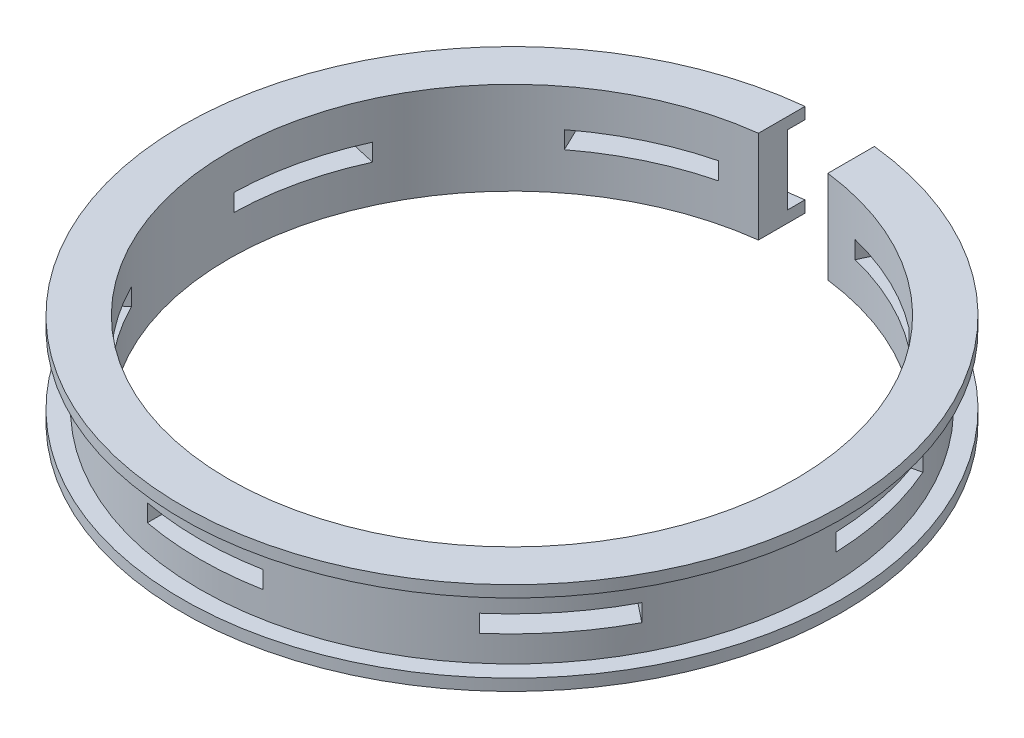
ISO-10303-21;
HEADER;
FILE_DESCRIPTION(('STEP AP214'),'2;1');
FILE_NAME('part.step','',(''),(''),'','','');
FILE_SCHEMA(('AUTOMOTIVE_DESIGN { 1 0 10303 214 1 1 1 1 }'));
ENDSEC;
DATA;
#1=APPLICATION_CONTEXT('core data for automotive mechanical design processes');
#2=APPLICATION_PROTOCOL_DEFINITION('international standard','automotive_design',2000,#1);
#3=PRODUCT_CONTEXT('',#1,'mechanical');
#4=PRODUCT('Part','Part','',(#3));
#5=PRODUCT_RELATED_PRODUCT_CATEGORY('part','',(#4));
#6=PRODUCT_DEFINITION_FORMATION('','',#4);
#7=PRODUCT_DEFINITION_CONTEXT('part definition',#1,'design');
#8=PRODUCT_DEFINITION('design','',#6,#7);
#9=PRODUCT_DEFINITION_SHAPE('','',#8);
#10=(LENGTH_UNIT() NAMED_UNIT(*) SI_UNIT(.MILLI.,.METRE.));
#11=(NAMED_UNIT(*) PLANE_ANGLE_UNIT() SI_UNIT($,.RADIAN.));
#12=(NAMED_UNIT(*) SI_UNIT($,.STERADIAN.) SOLID_ANGLE_UNIT());
#13=UNCERTAINTY_MEASURE_WITH_UNIT(LENGTH_MEASURE(1.E-05),#10,'distance_accuracy_value','');
#14=(GEOMETRIC_REPRESENTATION_CONTEXT(3) GLOBAL_UNCERTAINTY_ASSIGNED_CONTEXT((#13)) GLOBAL_UNIT_ASSIGNED_CONTEXT((#10,
#11,#12)) REPRESENTATION_CONTEXT('',''));
#15=CARTESIAN_POINT('',(0.,0.,0.));
#16=DIRECTION('',(0.,0.,1.));
#17=DIRECTION('',(1.,0.,0.));
#18=AXIS2_PLACEMENT_3D('',#15,#16,#17);
#19=CARTESIAN_POINT('',(0.,0.,0.));
#20=DIRECTION('',(0.,-1.,0.));
#21=DIRECTION('',(0.,0.,-1.));
#22=AXIS2_PLACEMENT_3D('',#19,#20,#21);
#23=CYLINDRICAL_SURFACE('',#22,24.5);
#24=CARTESIAN_POINT('',(0.,3.25,0.));
#25=DIRECTION('',(0.,1.,0.));
#26=DIRECTION('',(0.,0.,1.));
#27=AXIS2_PLACEMENT_3D('',#24,#25,#26);
#28=CIRCLE('',#27,24.5);
#29=CARTESIAN_POINT('',(-22.2704270119836,3.25,-10.2116639537302));
#30=VERTEX_POINT('',#29);
#31=CARTESIAN_POINT('',(-24.4956363515467,3.25,-0.462384831912012));
#32=VERTEX_POINT('',#31);
#33=EDGE_CURVE('E320',#30,#32,#28,.T.);
#34=ORIENTED_EDGE('',*,*,#33,.T.);
#35=DIRECTION('',(0.,-1.,0.));
#36=VECTOR('',#35,1.);
#37=CARTESIAN_POINT('',(-24.4956363515467,0.,-0.462384831912013));
#38=LINE('',#37,#36);
#39=CARTESIAN_POINT('',(-24.4956363515467,4.75000000000001,-0.462384831912012));
#40=VERTEX_POINT('',#39);
#41=EDGE_CURVE('E321',#32,#40,#38,.F.);
#42=ORIENTED_EDGE('',*,*,#41,.T.);
#43=CARTESIAN_POINT('',(0.,4.75000000000001,0.));
#44=DIRECTION('',(0.,-1.,0.));
#45=DIRECTION('',(0.,0.,-1.));
#46=AXIS2_PLACEMENT_3D('',#43,#44,#45);
#47=CIRCLE('',#46,24.5);
#48=CARTESIAN_POINT('',(-22.2704270119836,4.75000000000001,-10.2116639537302));
#49=VERTEX_POINT('',#48);
#50=EDGE_CURVE('E313',#40,#49,#47,.T.);
#51=ORIENTED_EDGE('',*,*,#50,.T.);
#52=DIRECTION('',(0.,-1.,0.));
#53=VECTOR('',#52,1.);
#54=CARTESIAN_POINT('',(-22.2704270119836,0.,-10.2116639537302));
#55=LINE('',#54,#53);
#56=EDGE_CURVE('E330',#49,#30,#55,.T.);
#57=ORIENTED_EDGE('',*,*,#56,.T.);
#58=EDGE_LOOP('',(#34,#42,#51,#57));
#59=FACE_BOUND('',#58,.T.);
#60=CARTESIAN_POINT('',(14.9112724366252,3.25,-19.4397519099587));
#61=VERTEX_POINT('',#60);
#62=CARTESIAN_POINT('',(5.90158375760104,3.25,-23.7785893011343));
#63=VERTEX_POINT('',#62);
#64=EDGE_CURVE('E317',#61,#63,#28,.T.);
#65=ORIENTED_EDGE('',*,*,#64,.T.);
#66=DIRECTION('',(0.,-1.,0.));
#67=VECTOR('',#66,1.);
#68=CARTESIAN_POINT('',(5.90158375760104,0.,-23.7785893011343));
#69=LINE('',#68,#67);
#70=CARTESIAN_POINT('',(5.90158375760104,4.75000000000001,-23.7785893011343));
#71=VERTEX_POINT('',#70);
#72=EDGE_CURVE('E341',#63,#71,#69,.F.);
#73=ORIENTED_EDGE('',*,*,#72,.T.);
#74=CARTESIAN_POINT('',(14.9112724366252,4.75000000000001,-19.4397519099587));
#75=VERTEX_POINT('',#74);
#76=EDGE_CURVE('E315',#71,#75,#47,.T.);
#77=ORIENTED_EDGE('',*,*,#76,.T.);
#78=DIRECTION('',(0.,-1.,0.));
#79=VECTOR('',#78,1.);
#80=CARTESIAN_POINT('',(14.9112724366252,0.,-19.4397519099587));
#81=LINE('',#80,#79);
#82=EDGE_CURVE('E344',#75,#61,#81,.T.);
#83=ORIENTED_EDGE('',*,*,#82,.T.);
#84=EDGE_LOOP('',(#65,#73,#77,#83));
#85=FACE_BOUND('',#84,.T.);
#86=CARTESIAN_POINT('',(21.8691844924211,4.75000000000001,11.0448526308163));
#87=VERTEX_POINT('',#86);
#88=CARTESIAN_POINT('',(15.6342864738337,4.75000000000001,18.8631674554965));
#89=VERTEX_POINT('',#88);
#90=EDGE_CURVE('E477',#87,#89,#47,.T.);
#91=ORIENTED_EDGE('',*,*,#90,.T.);
#92=DIRECTION('',(0.,-1.,0.));
#93=VECTOR('',#92,1.);
#94=CARTESIAN_POINT('',(15.6342864738337,0.,18.8631674554965));
#95=LINE('',#94,#93);
#96=CARTESIAN_POINT('',(15.6342864738337,3.25,18.8631674554965));
#97=VERTEX_POINT('',#96);
#98=EDGE_CURVE('E307',#89,#97,#95,.T.);
#99=ORIENTED_EDGE('',*,*,#98,.T.);
#100=CARTESIAN_POINT('',(21.8691844924211,3.25,11.0448526308163));
#101=VERTEX_POINT('',#100);
#102=EDGE_CURVE('E298',#97,#101,#28,.T.);
#103=ORIENTED_EDGE('',*,*,#102,.T.);
#104=DIRECTION('',(0.,-1.,0.));
#105=VECTOR('',#104,1.);
#106=CARTESIAN_POINT('',(21.8691844924211,0.,11.0448526308163));
#107=LINE('',#106,#105);
#108=EDGE_CURVE('E281',#101,#87,#107,.F.);
#109=ORIENTED_EDGE('',*,*,#108,.T.);
#110=EDGE_LOOP('',(#91,#99,#103,#109));
#111=FACE_BOUND('',#110,.T.);
#112=CARTESIAN_POINT('',(0.,0.,0.));
#113=DIRECTION('',(0.,-1.,0.));
#114=DIRECTION('',(0.,0.,-1.));
#115=AXIS2_PLACEMENT_3D('',#112,#113,#114);
#116=CIRCLE('',#115,24.5);
#117=CARTESIAN_POINT('',(3.,0.,-24.3156328315757));
#118=VERTEX_POINT('',#117);
#119=CARTESIAN_POINT('',(-3.,0.,-24.3156328315757));
#120=VERTEX_POINT('',#119);
#121=EDGE_CURVE('E568',#118,#120,#116,.T.);
#122=ORIENTED_EDGE('',*,*,#121,.T.);
#123=DIRECTION('',(0.,-1.,0.));
#124=VECTOR('',#123,1.);
#125=CARTESIAN_POINT('',(-3.,0.,-24.3156328315757));
#126=LINE('',#125,#124);
#127=CARTESIAN_POINT('',(-3.,8.,-24.3156328315757));
#128=VERTEX_POINT('',#127);
#129=EDGE_CURVE('E544',#120,#128,#126,.F.);
#130=ORIENTED_EDGE('',*,*,#129,.T.);
#131=CARTESIAN_POINT('',(0.,8.,0.));
#132=DIRECTION('',(0.,-1.,0.));
#133=DIRECTION('',(0.,0.,-1.));
#134=AXIS2_PLACEMENT_3D('',#131,#132,#133);
#135=CIRCLE('',#134,24.5);
#136=CARTESIAN_POINT('',(3.,8.,-24.3156328315757));
#137=VERTEX_POINT('',#136);
#138=EDGE_CURVE('E565',#137,#128,#135,.T.);
#139=ORIENTED_EDGE('',*,*,#138,.F.);
#140=DIRECTION('',(0.,-1.,0.));
#141=VECTOR('',#140,1.);
#142=CARTESIAN_POINT('',(3.,0.,-24.3156328315757));
#143=LINE('',#142,#141);
#144=EDGE_CURVE('E529',#137,#118,#143,.T.);
#145=ORIENTED_EDGE('',*,*,#144,.T.);
#146=EDGE_LOOP('',(#122,#130,#139,#145));
#147=FACE_BOUND('',#146,.T.);
#148=CARTESIAN_POINT('',(0.,3.25,0.));
#149=DIRECTION('',(0.,1.,0.));
#150=DIRECTION('',(0.,0.,1.));
#151=AXIS2_PLACEMENT_3D('',#148,#149,#150);
#152=CIRCLE('',#151,24.5);
#153=CARTESIAN_POINT('',(-5.,3.25,23.9843699104229));
#154=VERTEX_POINT('',#153);
#155=CARTESIAN_POINT('',(5.,3.25,23.9843699104229));
#156=VERTEX_POINT('',#155);
#157=EDGE_CURVE('E495',#154,#156,#152,.T.);
#158=ORIENTED_EDGE('',*,*,#157,.T.);
#159=DIRECTION('',(0.,-1.,0.));
#160=VECTOR('',#159,1.);
#161=CARTESIAN_POINT('',(5.,0.,23.9843699104229));
#162=LINE('',#161,#160);
#163=CARTESIAN_POINT('',(5.,4.75000000000001,23.9843699104229));
#164=VERTEX_POINT('',#163);
#165=EDGE_CURVE('E504',#156,#164,#162,.F.);
#166=ORIENTED_EDGE('',*,*,#165,.T.);
#167=CARTESIAN_POINT('',(0.,4.75000000000001,0.));
#168=DIRECTION('',(0.,-1.,0.));
#169=DIRECTION('',(0.,0.,-1.));
#170=AXIS2_PLACEMENT_3D('',#167,#168,#169);
#171=CIRCLE('',#170,24.5);
#172=CARTESIAN_POINT('',(-5.,4.75000000000001,23.9843699104229));
#173=VERTEX_POINT('',#172);
#174=EDGE_CURVE('E501',#164,#173,#171,.T.);
#175=ORIENTED_EDGE('',*,*,#174,.T.);
#176=DIRECTION('',(0.,-1.,0.));
#177=VECTOR('',#176,1.);
#178=CARTESIAN_POINT('',(-5.,0.,23.9843699104229));
#179=LINE('',#178,#177);
#180=EDGE_CURVE('E498',#173,#154,#179,.T.);
#181=ORIENTED_EDGE('',*,*,#180,.T.);
#182=EDGE_LOOP('',(#158,#166,#175,#181));
#183=FACE_BOUND('',#182,.T.);
#184=CARTESIAN_POINT('',(24.4956363515467,3.25,-0.462384831911679));
#185=VERTEX_POINT('',#184);
#186=CARTESIAN_POINT('',(22.2704270119837,3.25,-10.2116639537299));
#187=VERTEX_POINT('',#186);
#188=EDGE_CURVE('E309',#185,#187,#28,.T.);
#189=ORIENTED_EDGE('',*,*,#188,.T.);
#190=DIRECTION('',(0.,-1.,0.));
#191=VECTOR('',#190,1.);
#192=CARTESIAN_POINT('',(22.2704270119837,0.,-10.2116639537299));
#193=LINE('',#192,#191);
#194=CARTESIAN_POINT('',(22.2704270119837,4.75000000000001,-10.2116639537299));
#195=VERTEX_POINT('',#194);
#196=EDGE_CURVE('E347',#187,#195,#193,.F.);
#197=ORIENTED_EDGE('',*,*,#196,.T.);
#198=CARTESIAN_POINT('',(24.4956363515467,4.75000000000001,-0.462384831911678));
#199=VERTEX_POINT('',#198);
#200=EDGE_CURVE('E478',#195,#199,#47,.T.);
#201=ORIENTED_EDGE('',*,*,#200,.T.);
#202=DIRECTION('',(0.,-1.,0.));
#203=VECTOR('',#202,1.);
#204=CARTESIAN_POINT('',(24.4956363515467,0.,-0.462384831911679));
#205=LINE('',#204,#203);
#206=EDGE_CURVE('E292',#199,#185,#205,.T.);
#207=ORIENTED_EDGE('',*,*,#206,.T.);
#208=EDGE_LOOP('',(#189,#197,#201,#207));
#209=FACE_BOUND('',#208,.T.);
#210=CARTESIAN_POINT('',(-5.90158375760071,3.25,-23.7785893011344));
#211=VERTEX_POINT('',#210);
#212=CARTESIAN_POINT('',(-14.9112724366249,3.25,-19.4397519099589));
#213=VERTEX_POINT('',#212);
#214=EDGE_CURVE('E326',#211,#213,#28,.T.);
#215=ORIENTED_EDGE('',*,*,#214,.T.);
#216=DIRECTION('',(0.,-1.,0.));
#217=VECTOR('',#216,1.);
#218=CARTESIAN_POINT('',(-14.9112724366249,0.,-19.4397519099589));
#219=LINE('',#218,#217);
#220=CARTESIAN_POINT('',(-14.9112724366249,4.75000000000001,-19.4397519099589));
#221=VERTEX_POINT('',#220);
#222=EDGE_CURVE('E335',#213,#221,#219,.F.);
#223=ORIENTED_EDGE('',*,*,#222,.T.);
#224=CARTESIAN_POINT('',(-5.90158375760071,4.75000000000001,-23.7785893011344));
#225=VERTEX_POINT('',#224);
#226=EDGE_CURVE('E308',#221,#225,#47,.T.);
#227=ORIENTED_EDGE('',*,*,#226,.T.);
#228=DIRECTION('',(0.,-1.,0.));
#229=VECTOR('',#228,1.);
#230=CARTESIAN_POINT('',(-5.90158375760071,0.,-23.7785893011344));
#231=LINE('',#230,#229);
#232=EDGE_CURVE('E338',#225,#211,#231,.T.);
#233=ORIENTED_EDGE('',*,*,#232,.T.);
#234=EDGE_LOOP('',(#215,#223,#227,#233));
#235=FACE_BOUND('',#234,.T.);
#236=DIRECTION('',(0.,-1.,0.));
#237=VECTOR('',#236,1.);
#238=CARTESIAN_POINT('',(-15.6342864738339,0.,18.8631674554963));
#239=LINE('',#238,#237);
#240=CARTESIAN_POINT('',(-15.6342864738339,3.25,18.8631674554963));
#241=VERTEX_POINT('',#240);
#242=CARTESIAN_POINT('',(-15.6342864738339,4.75000000000001,18.8631674554963));
#243=VERTEX_POINT('',#242);
#244=EDGE_CURVE('E482',#241,#243,#239,.F.);
#245=ORIENTED_EDGE('',*,*,#244,.T.);
#246=CARTESIAN_POINT('',(-21.8691844924212,4.75000000000001,11.044852630816));
#247=VERTEX_POINT('',#246);
#248=EDGE_CURVE('E476',#243,#247,#47,.T.);
#249=ORIENTED_EDGE('',*,*,#248,.T.);
#250=DIRECTION('',(0.,-1.,0.));
#251=VECTOR('',#250,1.);
#252=CARTESIAN_POINT('',(-21.8691844924212,0.,11.044852630816));
#253=LINE('',#252,#251);
#254=CARTESIAN_POINT('',(-21.8691844924212,3.25,11.044852630816));
#255=VERTEX_POINT('',#254);
#256=EDGE_CURVE('E480',#247,#255,#253,.T.);
#257=ORIENTED_EDGE('',*,*,#256,.T.);
#258=EDGE_CURVE('E311',#255,#241,#28,.T.);
#259=ORIENTED_EDGE('',*,*,#258,.T.);
#260=EDGE_LOOP('',(#245,#249,#257,#259));
#261=FACE_BOUND('',#260,.T.);
#262=ADVANCED_FACE('F46',(#59,#85,#111,#147,#183,#209,#235,#261),#23,.F.);
#263=CARTESIAN_POINT('',(0.,0.,0.));
#264=DIRECTION('',(0.,-1.,0.));
#265=DIRECTION('',(0.,0.,-1.));
#266=AXIS2_PLACEMENT_3D('',#263,#264,#265);
#267=CYLINDRICAL_SURFACE('',#266,27.);
#268=CARTESIAN_POINT('',(0.,4.75000000000001,0.));
#269=DIRECTION('',(0.,-1.,0.));
#270=DIRECTION('',(0.,0.,-1.));
#271=AXIS2_PLACEMENT_3D('',#268,#269,#270);
#272=CIRCLE('',#271,27.);
#273=CARTESIAN_POINT('',(-24.7551559890317,4.75000000000001,-10.7787871283696));
#274=VERTEX_POINT('',#273);
#275=CARTESIAN_POINT('',(-26.9803653285949,4.75000000000001,-1.02950800655138));
#276=VERTEX_POINT('',#275);
#277=EDGE_CURVE('E56',#274,#276,#272,.F.);
#278=ORIENTED_EDGE('',*,*,#277,.T.);
#279=DIRECTION('',(0.,-1.,0.));
#280=VECTOR('',#279,1.);
#281=CARTESIAN_POINT('',(-26.9803653285949,0.,-1.02950800655138));
#282=LINE('',#281,#280);
#283=CARTESIAN_POINT('',(-26.9803653285949,3.25,-1.02950800655138));
#284=VERTEX_POINT('',#283);
#285=EDGE_CURVE('E426',#276,#284,#282,.T.);
#286=ORIENTED_EDGE('',*,*,#285,.T.);
#287=CARTESIAN_POINT('',(0.,3.25,0.));
#288=DIRECTION('',(0.,1.,0.));
#289=DIRECTION('',(0.,0.,1.));
#290=AXIS2_PLACEMENT_3D('',#287,#288,#289);
#291=CIRCLE('',#290,27.);
#292=CARTESIAN_POINT('',(-24.7551559890317,3.25,-10.7787871283696));
#293=VERTEX_POINT('',#292);
#294=EDGE_CURVE('E427',#284,#293,#291,.F.);
#295=ORIENTED_EDGE('',*,*,#294,.T.);
#296=DIRECTION('',(0.,-1.,0.));
#297=VECTOR('',#296,1.);
#298=CARTESIAN_POINT('',(-24.7551559890317,0.,-10.7787871283696));
#299=LINE('',#298,#297);
#300=EDGE_CURVE('E457',#293,#274,#299,.F.);
#301=ORIENTED_EDGE('',*,*,#300,.T.);
#302=EDGE_LOOP('',(#278,#286,#295,#301));
#303=FACE_BOUND('',#302,.T.);
#304=CARTESIAN_POINT('',(16.0170808618274,4.75000000000001,-21.7359867654009));
#305=VERTEX_POINT('',#304);
#306=CARTESIAN_POINT('',(7.00739218280321,4.75000000000001,-26.0748241565766));
#307=VERTEX_POINT('',#306);
#308=EDGE_CURVE('E436',#305,#307,#272,.F.);
#309=ORIENTED_EDGE('',*,*,#308,.T.);
#310=DIRECTION('',(0.,-1.,0.));
#311=VECTOR('',#310,1.);
#312=CARTESIAN_POINT('',(7.00739218280321,0.,-26.0748241565766));
#313=LINE('',#312,#311);
#314=CARTESIAN_POINT('',(7.00739218280321,3.25,-26.0748241565766));
#315=VERTEX_POINT('',#314);
#316=EDGE_CURVE('E445',#307,#315,#313,.T.);
#317=ORIENTED_EDGE('',*,*,#316,.T.);
#318=CARTESIAN_POINT('',(16.0170808618274,3.25,-21.7359867654009));
#319=VERTEX_POINT('',#318);
#320=EDGE_CURVE('E430',#315,#319,#291,.F.);
#321=ORIENTED_EDGE('',*,*,#320,.T.);
#322=DIRECTION('',(0.,-1.,0.));
#323=VECTOR('',#322,1.);
#324=CARTESIAN_POINT('',(16.0170808618274,0.,-21.7359867654009));
#325=LINE('',#324,#323);
#326=EDGE_CURVE('E439',#319,#305,#325,.F.);
#327=ORIENTED_EDGE('',*,*,#326,.T.);
#328=EDGE_LOOP('',(#309,#317,#321,#327));
#329=FACE_BOUND('',#328,.T.);
#330=CARTESIAN_POINT('',(23.8617824223638,3.25,12.6338964546878));
#331=VERTEX_POINT('',#330);
#332=CARTESIAN_POINT('',(17.6268844037763,3.25,20.452211279368));
#333=VERTEX_POINT('',#332);
#334=EDGE_CURVE('E301',#331,#333,#291,.F.);
#335=ORIENTED_EDGE('',*,*,#334,.T.);
#336=DIRECTION('',(0.,-1.,0.));
#337=VECTOR('',#336,1.);
#338=CARTESIAN_POINT('',(17.6268844037763,0.,20.452211279368));
#339=LINE('',#338,#337);
#340=CARTESIAN_POINT('',(17.6268844037763,4.75000000000001,20.452211279368));
#341=VERTEX_POINT('',#340);
#342=EDGE_CURVE('E412',#333,#341,#339,.F.);
#343=ORIENTED_EDGE('',*,*,#342,.T.);
#344=CARTESIAN_POINT('',(23.8617824223638,4.75000000000001,12.6338964546878));
#345=VERTEX_POINT('',#344);
#346=EDGE_CURVE('E57',#341,#345,#272,.F.);
#347=ORIENTED_EDGE('',*,*,#346,.T.);
#348=DIRECTION('',(0.,-1.,0.));
#349=VECTOR('',#348,1.);
#350=CARTESIAN_POINT('',(23.8617824223638,0.,12.6338964546878));
#351=LINE('',#350,#349);
#352=EDGE_CURVE('E417',#345,#331,#351,.T.);
#353=ORIENTED_EDGE('',*,*,#352,.T.);
#354=EDGE_LOOP('',(#335,#343,#347,#353));
#355=FACE_BOUND('',#354,.T.);
#356=CARTESIAN_POINT('',(0.,7.,0.));
#357=DIRECTION('',(0.,-1.,0.));
#358=DIRECTION('',(0.,0.,-1.));
#359=AXIS2_PLACEMENT_3D('',#356,#357,#358);
#360=CIRCLE('',#359,27.);
#361=CARTESIAN_POINT('',(3.,7.,-26.8328157299975));
#362=VERTEX_POINT('',#361);
#363=CARTESIAN_POINT('',(-3.,7.,-26.8328157299975));
#364=VERTEX_POINT('',#363);
#365=EDGE_CURVE('E556',#362,#364,#360,.T.);
#366=ORIENTED_EDGE('',*,*,#365,.T.);
#367=DIRECTION('',(0.,-1.,0.));
#368=VECTOR('',#367,1.);
#369=CARTESIAN_POINT('',(-3.,0.,-26.8328157299975));
#370=LINE('',#369,#368);
#371=CARTESIAN_POINT('',(-3.,1.,-26.8328157299975));
#372=VERTEX_POINT('',#371);
#373=EDGE_CURVE('E535',#364,#372,#370,.T.);
#374=ORIENTED_EDGE('',*,*,#373,.T.);
#375=CARTESIAN_POINT('',(0.,1.,0.));
#376=DIRECTION('',(0.,-1.,0.));
#377=DIRECTION('',(0.,0.,-1.));
#378=AXIS2_PLACEMENT_3D('',#375,#376,#377);
#379=CIRCLE('',#378,27.);
#380=CARTESIAN_POINT('',(3.,1.,-26.8328157299975));
#381=VERTEX_POINT('',#380);
#382=EDGE_CURVE('E553',#381,#372,#379,.T.);
#383=ORIENTED_EDGE('',*,*,#382,.F.);
#384=DIRECTION('',(0.,-1.,0.));
#385=VECTOR('',#384,1.);
#386=CARTESIAN_POINT('',(3.,0.,-26.8328157299975));
#387=LINE('',#386,#385);
#388=EDGE_CURVE('E520',#381,#362,#387,.F.);
#389=ORIENTED_EDGE('',*,*,#388,.T.);
#390=EDGE_LOOP('',(#366,#374,#383,#389));
#391=FACE_BOUND('',#390,.T.);
#392=CARTESIAN_POINT('',(0.,4.75000000000001,0.));
#393=DIRECTION('',(0.,-1.,0.));
#394=DIRECTION('',(0.,0.,-1.));
#395=AXIS2_PLACEMENT_3D('',#392,#393,#394);
#396=CIRCLE('',#395,27.);
#397=CARTESIAN_POINT('',(-5.,4.75000000000001,26.5329983228432));
#398=VERTEX_POINT('',#397);
#399=CARTESIAN_POINT('',(5.,4.75000000000001,26.5329983228432));
#400=VERTEX_POINT('',#399);
#401=EDGE_CURVE('E583',#398,#400,#396,.F.);
#402=ORIENTED_EDGE('',*,*,#401,.T.);
#403=DIRECTION('',(0.,-1.,0.));
#404=VECTOR('',#403,1.);
#405=CARTESIAN_POINT('',(5.,0.,26.5329983228432));
#406=LINE('',#405,#404);
#407=CARTESIAN_POINT('',(5.,3.25,26.5329983228432));
#408=VERTEX_POINT('',#407);
#409=EDGE_CURVE('E422',#400,#408,#406,.T.);
#410=ORIENTED_EDGE('',*,*,#409,.T.);
#411=CARTESIAN_POINT('',(0.,3.25,0.));
#412=DIRECTION('',(0.,1.,0.));
#413=DIRECTION('',(0.,0.,1.));
#414=AXIS2_PLACEMENT_3D('',#411,#412,#413);
#415=CIRCLE('',#414,27.);
#416=CARTESIAN_POINT('',(-5.,3.25,26.5329983228432));
#417=VERTEX_POINT('',#416);
#418=EDGE_CURVE('E577',#408,#417,#415,.F.);
#419=ORIENTED_EDGE('',*,*,#418,.T.);
#420=DIRECTION('',(0.,-1.,0.));
#421=VECTOR('',#420,1.);
#422=CARTESIAN_POINT('',(-5.,0.,26.5329983228432));
#423=LINE('',#422,#421);
#424=EDGE_CURVE('E580',#417,#398,#423,.F.);
#425=ORIENTED_EDGE('',*,*,#424,.T.);
#426=EDGE_LOOP('',(#402,#410,#419,#425));
#427=FACE_BOUND('',#426,.T.);
#428=CARTESIAN_POINT('',(26.9803653285949,4.75000000000001,-1.02950800655102));
#429=VERTEX_POINT('',#428);
#430=CARTESIAN_POINT('',(24.7551559890319,4.75000000000001,-10.7787871283693));
#431=VERTEX_POINT('',#430);
#432=EDGE_CURVE('E421',#429,#431,#272,.F.);
#433=ORIENTED_EDGE('',*,*,#432,.T.);
#434=DIRECTION('',(0.,-1.,0.));
#435=VECTOR('',#434,1.);
#436=CARTESIAN_POINT('',(24.7551559890319,0.,-10.7787871283693));
#437=LINE('',#436,#435);
#438=CARTESIAN_POINT('',(24.7551559890319,3.25,-10.7787871283693));
#439=VERTEX_POINT('',#438);
#440=EDGE_CURVE('E435',#431,#439,#437,.T.);
#441=ORIENTED_EDGE('',*,*,#440,.T.);
#442=CARTESIAN_POINT('',(26.9803653285949,3.25,-1.02950800655101));
#443=VERTEX_POINT('',#442);
#444=EDGE_CURVE('E420',#439,#443,#291,.F.);
#445=ORIENTED_EDGE('',*,*,#444,.T.);
#446=DIRECTION('',(0.,-1.,0.));
#447=VECTOR('',#446,1.);
#448=CARTESIAN_POINT('',(26.9803653285949,0.,-1.02950800655102));
#449=LINE('',#448,#447);
#450=EDGE_CURVE('E429',#443,#429,#449,.F.);
#451=ORIENTED_EDGE('',*,*,#450,.T.);
#452=EDGE_LOOP('',(#433,#441,#445,#451));
#453=FACE_BOUND('',#452,.T.);
#454=CARTESIAN_POINT('',(-7.00739218280285,4.75000000000001,-26.0748241565766));
#455=VERTEX_POINT('',#454);
#456=CARTESIAN_POINT('',(-16.0170808618271,4.75000000000001,-21.7359867654011));
#457=VERTEX_POINT('',#456);
#458=EDGE_CURVE('E446',#455,#457,#272,.F.);
#459=ORIENTED_EDGE('',*,*,#458,.T.);
#460=DIRECTION('',(0.,-1.,0.));
#461=VECTOR('',#460,1.);
#462=CARTESIAN_POINT('',(-16.0170808618271,0.,-21.7359867654011));
#463=LINE('',#462,#461);
#464=CARTESIAN_POINT('',(-16.0170808618271,3.25,-21.7359867654011));
#465=VERTEX_POINT('',#464);
#466=EDGE_CURVE('E454',#457,#465,#463,.T.);
#467=ORIENTED_EDGE('',*,*,#466,.T.);
#468=CARTESIAN_POINT('',(-7.00739218280285,3.25,-26.0748241565766));
#469=VERTEX_POINT('',#468);
#470=EDGE_CURVE('E440',#465,#469,#291,.F.);
#471=ORIENTED_EDGE('',*,*,#470,.T.);
#472=DIRECTION('',(0.,-1.,0.));
#473=VECTOR('',#472,1.);
#474=CARTESIAN_POINT('',(-7.00739218280285,0.,-26.0748241565766));
#475=LINE('',#474,#473);
#476=EDGE_CURVE('E449',#469,#455,#475,.F.);
#477=ORIENTED_EDGE('',*,*,#476,.T.);
#478=EDGE_LOOP('',(#459,#467,#471,#477));
#479=FACE_BOUND('',#478,.T.);
#480=DIRECTION('',(0.,-1.,0.));
#481=VECTOR('',#480,1.);
#482=CARTESIAN_POINT('',(-23.8617824223639,0.,12.6338964546874));
#483=LINE('',#482,#481);
#484=CARTESIAN_POINT('',(-23.8617824223639,3.25,12.6338964546874));
#485=VERTEX_POINT('',#484);
#486=CARTESIAN_POINT('',(-23.8617824223639,4.75000000000001,12.6338964546874));
#487=VERTEX_POINT('',#486);
#488=EDGE_CURVE('E425',#485,#487,#483,.F.);
#489=ORIENTED_EDGE('',*,*,#488,.T.);
#490=CARTESIAN_POINT('',(-17.6268844037766,4.75000000000001,20.4522112793677));
#491=VERTEX_POINT('',#490);
#492=EDGE_CURVE('E13',#487,#491,#272,.F.);
#493=ORIENTED_EDGE('',*,*,#492,.T.);
#494=DIRECTION('',(0.,-1.,0.));
#495=VECTOR('',#494,1.);
#496=CARTESIAN_POINT('',(-17.6268844037766,0.,20.4522112793677));
#497=LINE('',#496,#495);
#498=CARTESIAN_POINT('',(-17.6268844037766,3.25,20.4522112793677));
#499=VERTEX_POINT('',#498);
#500=EDGE_CURVE('E50',#491,#499,#497,.T.);
#501=ORIENTED_EDGE('',*,*,#500,.T.);
#502=EDGE_CURVE('E419',#499,#485,#291,.F.);
#503=ORIENTED_EDGE('',*,*,#502,.T.);
#504=EDGE_LOOP('',(#489,#493,#501,#503));
#505=FACE_BOUND('',#504,.T.);
#506=ADVANCED_FACE('F414',(#303,#329,#355,#391,#427,#453,#479,#505),#267,.T.);
#507=CARTESIAN_POINT('',(28.5,0.,0.));
#508=DIRECTION('',(0.,-1.,0.));
#509=DIRECTION('',(0.,0.,-1.));
#510=AXIS2_PLACEMENT_3D('',#507,#508,#509);
#511=PLANE('',#510);
#512=CARTESIAN_POINT('',(0.,0.,0.));
#513=DIRECTION('',(0.,-1.,0.));
#514=DIRECTION('',(0.,0.,-1.));
#515=AXIS2_PLACEMENT_3D('',#512,#513,#514);
#516=CIRCLE('',#515,28.5);
#517=CARTESIAN_POINT('',(3.,0.,-28.3416654415368));
#518=VERTEX_POINT('',#517);
#519=CARTESIAN_POINT('',(-3.,0.,-28.3416654415368));
#520=VERTEX_POINT('',#519);
#521=EDGE_CURVE('E547',#518,#520,#516,.T.);
#522=ORIENTED_EDGE('',*,*,#521,.T.);
#523=DIRECTION('',(0.,0.,1.));
#524=VECTOR('',#523,1.);
#525=CARTESIAN_POINT('',(-3.,0.,-57.));
#526=LINE('',#525,#524);
#527=EDGE_CURVE('E507',#520,#120,#526,.T.);
#528=ORIENTED_EDGE('',*,*,#527,.T.);
#529=ORIENTED_EDGE('',*,*,#121,.F.);
#530=DIRECTION('',(0.,0.,-1.));
#531=VECTOR('',#530,1.);
#532=CARTESIAN_POINT('',(3.,0.,-57.0000000000001));
#533=LINE('',#532,#531);
#534=EDGE_CURVE('E511',#118,#518,#533,.T.);
#535=ORIENTED_EDGE('',*,*,#534,.T.);
#536=EDGE_LOOP('',(#522,#528,#529,#535));
#537=FACE_BOUND('',#536,.T.);
#538=ADVANCED_FACE('F48',(#537),#511,.T.);
#539=CARTESIAN_POINT('',(24.5,8.,0.));
#540=DIRECTION('',(0.,1.,0.));
#541=DIRECTION('',(0.,0.,1.));
#542=AXIS2_PLACEMENT_3D('',#539,#540,#541);
#543=PLANE('',#542);
#544=ORIENTED_EDGE('',*,*,#138,.T.);
#545=DIRECTION('',(0.,0.,1.));
#546=VECTOR('',#545,1.);
#547=CARTESIAN_POINT('',(-3.,8.,-57.));
#548=LINE('',#547,#546);
#549=CARTESIAN_POINT('',(-3.,8.,-28.3416654415368));
#550=VERTEX_POINT('',#549);
#551=EDGE_CURVE('E508',#550,#128,#548,.T.);
#552=ORIENTED_EDGE('',*,*,#551,.F.);
#553=CARTESIAN_POINT('',(0.,8.,0.));
#554=DIRECTION('',(0.,-1.,0.));
#555=DIRECTION('',(0.,0.,-1.));
#556=AXIS2_PLACEMENT_3D('',#553,#554,#555);
#557=CIRCLE('',#556,28.5);
#558=CARTESIAN_POINT('',(3.,8.,-28.3416654415368));
#559=VERTEX_POINT('',#558);
#560=EDGE_CURVE('E562',#559,#550,#557,.T.);
#561=ORIENTED_EDGE('',*,*,#560,.F.);
#562=DIRECTION('',(0.,0.,-1.));
#563=VECTOR('',#562,1.);
#564=CARTESIAN_POINT('',(3.,8.,-57.0000000000001));
#565=LINE('',#564,#563);
#566=EDGE_CURVE('E510',#137,#559,#565,.T.);
#567=ORIENTED_EDGE('',*,*,#566,.F.);
#568=EDGE_LOOP('',(#544,#552,#561,#567));
#569=FACE_BOUND('',#568,.T.);
#570=ADVANCED_FACE('F618',(#569),#543,.T.);
#571=CARTESIAN_POINT('',(0.,0.,0.));
#572=DIRECTION('',(0.,-1.,0.));
#573=DIRECTION('',(0.,0.,-1.));
#574=AXIS2_PLACEMENT_3D('',#571,#572,#573);
#575=CYLINDRICAL_SURFACE('',#574,28.5);
#576=ORIENTED_EDGE('',*,*,#560,.T.);
#577=DIRECTION('',(0.,-1.,0.));
#578=VECTOR('',#577,1.);
#579=CARTESIAN_POINT('',(-3.,0.,-28.3416654415368));
#580=LINE('',#579,#578);
#581=CARTESIAN_POINT('',(-3.,7.,-28.3416654415368));
#582=VERTEX_POINT('',#581);
#583=EDGE_CURVE('E541',#550,#582,#580,.T.);
#584=ORIENTED_EDGE('',*,*,#583,.T.);
#585=CARTESIAN_POINT('',(0.,7.,0.));
#586=DIRECTION('',(0.,-1.,0.));
#587=DIRECTION('',(0.,0.,-1.));
#588=AXIS2_PLACEMENT_3D('',#585,#586,#587);
#589=CIRCLE('',#588,28.5);
#590=CARTESIAN_POINT('',(3.,7.,-28.3416654415368));
#591=VERTEX_POINT('',#590);
#592=EDGE_CURVE('E559',#591,#582,#589,.T.);
#593=ORIENTED_EDGE('',*,*,#592,.F.);
#594=DIRECTION('',(0.,-1.,0.));
#595=VECTOR('',#594,1.);
#596=CARTESIAN_POINT('',(3.,0.,-28.3416654415368));
#597=LINE('',#596,#595);
#598=EDGE_CURVE('E526',#591,#559,#597,.F.);
#599=ORIENTED_EDGE('',*,*,#598,.T.);
#600=EDGE_LOOP('',(#576,#584,#593,#599));
#601=FACE_BOUND('',#600,.T.);
#602=ADVANCED_FACE('F621',(#601),#575,.T.);
#603=CARTESIAN_POINT('',(28.5,7.,0.));
#604=DIRECTION('',(0.,-1.,0.));
#605=DIRECTION('',(0.,0.,-1.));
#606=AXIS2_PLACEMENT_3D('',#603,#604,#605);
#607=PLANE('',#606);
#608=ORIENTED_EDGE('',*,*,#592,.T.);
#609=DIRECTION('',(0.,0.,1.));
#610=VECTOR('',#609,1.);
#611=CARTESIAN_POINT('',(-2.99999999999999,7.,0.));
#612=LINE('',#611,#610);
#613=EDGE_CURVE('E538',#582,#364,#612,.T.);
#614=ORIENTED_EDGE('',*,*,#613,.T.);
#615=ORIENTED_EDGE('',*,*,#365,.F.);
#616=DIRECTION('',(0.,0.,-1.));
#617=VECTOR('',#616,1.);
#618=CARTESIAN_POINT('',(2.99999999999999,7.,0.));
#619=LINE('',#618,#617);
#620=EDGE_CURVE('E523',#362,#591,#619,.T.);
#621=ORIENTED_EDGE('',*,*,#620,.T.);
#622=EDGE_LOOP('',(#608,#614,#615,#621));
#623=FACE_BOUND('',#622,.T.);
#624=ADVANCED_FACE('F625',(#623),#607,.T.);
#625=CARTESIAN_POINT('',(27.,1.,0.));
#626=DIRECTION('',(0.,1.,0.));
#627=DIRECTION('',(0.,0.,1.));
#628=AXIS2_PLACEMENT_3D('',#625,#626,#627);
#629=PLANE('',#628);
#630=ORIENTED_EDGE('',*,*,#382,.T.);
#631=DIRECTION('',(0.,0.,-1.));
#632=VECTOR('',#631,1.);
#633=CARTESIAN_POINT('',(-2.99999999999999,1.,0.));
#634=LINE('',#633,#632);
#635=CARTESIAN_POINT('',(-3.,1.,-28.3416654415368));
#636=VERTEX_POINT('',#635);
#637=EDGE_CURVE('E532',#372,#636,#634,.T.);
#638=ORIENTED_EDGE('',*,*,#637,.T.);
#639=CARTESIAN_POINT('',(0.,1.,0.));
#640=DIRECTION('',(0.,-1.,0.));
#641=DIRECTION('',(0.,0.,-1.));
#642=AXIS2_PLACEMENT_3D('',#639,#640,#641);
#643=CIRCLE('',#642,28.5);
#644=CARTESIAN_POINT('',(3.,1.,-28.3416654415368));
#645=VERTEX_POINT('',#644);
#646=EDGE_CURVE('E550',#645,#636,#643,.T.);
#647=ORIENTED_EDGE('',*,*,#646,.F.);
#648=DIRECTION('',(0.,0.,1.));
#649=VECTOR('',#648,1.);
#650=CARTESIAN_POINT('',(2.99999999999999,1.,0.));
#651=LINE('',#650,#649);
#652=EDGE_CURVE('E513',#645,#381,#651,.T.);
#653=ORIENTED_EDGE('',*,*,#652,.T.);
#654=EDGE_LOOP('',(#630,#638,#647,#653));
#655=FACE_BOUND('',#654,.T.);
#656=ADVANCED_FACE('F628',(#655),#629,.T.);
#657=CARTESIAN_POINT('',(0.,0.,0.));
#658=DIRECTION('',(0.,-1.,0.));
#659=DIRECTION('',(0.,0.,-1.));
#660=AXIS2_PLACEMENT_3D('',#657,#658,#659);
#661=CYLINDRICAL_SURFACE('',#660,28.5);
#662=ORIENTED_EDGE('',*,*,#646,.T.);
#663=DIRECTION('',(0.,-1.,0.));
#664=VECTOR('',#663,1.);
#665=CARTESIAN_POINT('',(-3.,0.,-28.3416654415368));
#666=LINE('',#665,#664);
#667=EDGE_CURVE('E574',#636,#520,#666,.T.);
#668=ORIENTED_EDGE('',*,*,#667,.T.);
#669=ORIENTED_EDGE('',*,*,#521,.F.);
#670=DIRECTION('',(0.,-1.,0.));
#671=VECTOR('',#670,1.);
#672=CARTESIAN_POINT('',(3.,0.,-28.3416654415368));
#673=LINE('',#672,#671);
#674=EDGE_CURVE('E571',#518,#645,#673,.F.);
#675=ORIENTED_EDGE('',*,*,#674,.T.);
#676=EDGE_LOOP('',(#662,#668,#669,#675));
#677=FACE_BOUND('',#676,.T.);
#678=ADVANCED_FACE('F633',(#677),#661,.T.);
#679=CARTESIAN_POINT('',(3.,8.,-57.0000000000001));
#680=DIRECTION('',(-1.,0.,0.));
#681=DIRECTION('',(0.,0.,1.));
#682=AXIS2_PLACEMENT_3D('',#679,#680,#681);
#683=PLANE('',#682);
#684=ORIENTED_EDGE('',*,*,#566,.T.);
#685=ORIENTED_EDGE('',*,*,#598,.F.);
#686=ORIENTED_EDGE('',*,*,#620,.F.);
#687=ORIENTED_EDGE('',*,*,#388,.F.);
#688=ORIENTED_EDGE('',*,*,#652,.F.);
#689=ORIENTED_EDGE('',*,*,#674,.F.);
#690=ORIENTED_EDGE('',*,*,#534,.F.);
#691=ORIENTED_EDGE('',*,*,#144,.F.);
#692=EDGE_LOOP('',(#684,#685,#686,#687,#688,#689,#690,#691));
#693=FACE_BOUND('',#692,.T.);
#694=ADVANCED_FACE('F637',(#693),#683,.T.);
#695=CARTESIAN_POINT('',(-3.,8.,-57.));
#696=DIRECTION('',(1.,0.,0.));
#697=DIRECTION('',(0.,0.,-1.));
#698=AXIS2_PLACEMENT_3D('',#695,#696,#697);
#699=PLANE('',#698);
#700=ORIENTED_EDGE('',*,*,#527,.F.);
#701=ORIENTED_EDGE('',*,*,#667,.F.);
#702=ORIENTED_EDGE('',*,*,#637,.F.);
#703=ORIENTED_EDGE('',*,*,#373,.F.);
#704=ORIENTED_EDGE('',*,*,#613,.F.);
#705=ORIENTED_EDGE('',*,*,#583,.F.);
#706=ORIENTED_EDGE('',*,*,#551,.T.);
#707=ORIENTED_EDGE('',*,*,#129,.F.);
#708=EDGE_LOOP('',(#700,#701,#702,#703,#704,#705,#706,#707));
#709=FACE_BOUND('',#708,.T.);
#710=ADVANCED_FACE('F639',(#709),#699,.T.);
#711=CARTESIAN_POINT('',(5.,3.25,28.5));
#712=DIRECTION('',(-1.,0.,0.));
#713=DIRECTION('',(0.,0.,1.));
#714=AXIS2_PLACEMENT_3D('',#711,#712,#713);
#715=PLANE('',#714);
#716=DIRECTION('',(0.,0.,-1.));
#717=VECTOR('',#716,1.);
#718=CARTESIAN_POINT('',(5.,3.25,28.5));
#719=LINE('',#718,#717);
#720=EDGE_CURVE('E484',#408,#156,#719,.T.);
#721=ORIENTED_EDGE('',*,*,#720,.F.);
#722=ORIENTED_EDGE('',*,*,#409,.F.);
#723=DIRECTION('',(0.,0.,-1.));
#724=VECTOR('',#723,1.);
#725=CARTESIAN_POINT('',(5.,4.75000000000001,28.5));
#726=LINE('',#725,#724);
#727=EDGE_CURVE('E492',#400,#164,#726,.T.);
#728=ORIENTED_EDGE('',*,*,#727,.T.);
#729=ORIENTED_EDGE('',*,*,#165,.F.);
#730=EDGE_LOOP('',(#721,#722,#728,#729));
#731=FACE_BOUND('',#730,.T.);
#732=ADVANCED_FACE('F591',(#731),#715,.T.);
#733=CARTESIAN_POINT('',(-5.,4.75000000000001,28.5));
#734=DIRECTION('',(0.,-1.,0.));
#735=DIRECTION('',(0.,0.,-1.));
#736=AXIS2_PLACEMENT_3D('',#733,#734,#735);
#737=PLANE('',#736);
#738=ORIENTED_EDGE('',*,*,#727,.F.);
#739=ORIENTED_EDGE('',*,*,#401,.F.);
#740=DIRECTION('',(0.,0.,-1.));
#741=VECTOR('',#740,1.);
#742=CARTESIAN_POINT('',(-5.,4.75000000000001,28.5));
#743=LINE('',#742,#741);
#744=EDGE_CURVE('E489',#398,#173,#743,.T.);
#745=ORIENTED_EDGE('',*,*,#744,.T.);
#746=ORIENTED_EDGE('',*,*,#174,.F.);
#747=EDGE_LOOP('',(#738,#739,#745,#746));
#748=FACE_BOUND('',#747,.T.);
#749=ADVANCED_FACE('F594',(#748),#737,.T.);
#750=CARTESIAN_POINT('',(-5.,3.25,28.5));
#751=DIRECTION('',(1.,0.,0.));
#752=DIRECTION('',(0.,0.,-1.));
#753=AXIS2_PLACEMENT_3D('',#750,#751,#752);
#754=PLANE('',#753);
#755=ORIENTED_EDGE('',*,*,#744,.F.);
#756=ORIENTED_EDGE('',*,*,#424,.F.);
#757=DIRECTION('',(0.,0.,-1.));
#758=VECTOR('',#757,1.);
#759=CARTESIAN_POINT('',(-5.,3.25,28.5));
#760=LINE('',#759,#758);
#761=EDGE_CURVE('E486',#417,#154,#760,.T.);
#762=ORIENTED_EDGE('',*,*,#761,.T.);
#763=ORIENTED_EDGE('',*,*,#180,.F.);
#764=EDGE_LOOP('',(#755,#756,#762,#763));
#765=FACE_BOUND('',#764,.T.);
#766=ADVANCED_FACE('F602',(#765),#754,.T.);
#767=CARTESIAN_POINT('',(-5.,3.25,28.5));
#768=DIRECTION('',(0.,1.,0.));
#769=DIRECTION('',(0.,0.,1.));
#770=AXIS2_PLACEMENT_3D('',#767,#768,#769);
#771=PLANE('',#770);
#772=ORIENTED_EDGE('',*,*,#761,.F.);
#773=ORIENTED_EDGE('',*,*,#418,.F.);
#774=ORIENTED_EDGE('',*,*,#720,.T.);
#775=ORIENTED_EDGE('',*,*,#157,.F.);
#776=EDGE_LOOP('',(#772,#773,#774,#775));
#777=FACE_BOUND('',#776,.T.);
#778=ADVANCED_FACE('F599',(#777),#771,.T.);
#779=CARTESIAN_POINT('',(34.4310950667619,3.25,21.0626420273738));
#780=DIRECTION('',(-0.623489801858743,0.,0.781831482468022));
#781=DIRECTION('',(0.781831482468022,0.,0.623489801858743));
#782=AXIS2_PLACEMENT_3D('',#779,#780,#781);
#783=PLANE('',#782);
#784=DIRECTION('',(-0.781831482468022,0.,-0.623489801858743));
#785=VECTOR('',#784,1.);
#786=CARTESIAN_POINT('',(34.4310950667619,3.25,21.0626420273738));
#787=LINE('',#786,#785);
#788=EDGE_CURVE('E284',#331,#101,#787,.T.);
#789=ORIENTED_EDGE('',*,*,#788,.F.);
#790=ORIENTED_EDGE('',*,*,#352,.F.);
#791=DIRECTION('',(-0.781831482468022,0.,-0.623489801858743));
#792=VECTOR('',#791,1.);
#793=CARTESIAN_POINT('',(34.4310950667619,4.75000000000001,21.0626420273738));
#794=LINE('',#793,#792);
#795=EDGE_CURVE('E287',#345,#87,#794,.T.);
#796=ORIENTED_EDGE('',*,*,#795,.T.);
#797=ORIENTED_EDGE('',*,*,#108,.F.);
#798=EDGE_LOOP('',(#789,#790,#796,#797));
#799=FACE_BOUND('',#798,.T.);
#800=ADVANCED_FACE('F283',(#799),#783,.T.);
#801=CARTESIAN_POINT('',(28.1961970481745,3.25,28.880956852054));
#802=DIRECTION('',(0.623489801858743,0.,-0.781831482468022));
#803=DIRECTION('',(-0.781831482468022,0.,-0.623489801858743));
#804=AXIS2_PLACEMENT_3D('',#801,#802,#803);
#805=PLANE('',#804);
#806=DIRECTION('',(-0.781831482468022,0.,-0.623489801858743));
#807=VECTOR('',#806,1.);
#808=CARTESIAN_POINT('',(28.1961970481745,4.75000000000001,28.880956852054));
#809=LINE('',#808,#807);
#810=EDGE_CURVE('E405',#341,#89,#809,.T.);
#811=ORIENTED_EDGE('',*,*,#810,.F.);
#812=ORIENTED_EDGE('',*,*,#342,.F.);
#813=DIRECTION('',(-0.781831482468022,0.,-0.623489801858743));
#814=VECTOR('',#813,1.);
#815=CARTESIAN_POINT('',(28.1961970481745,3.25,28.880956852054));
#816=LINE('',#815,#814);
#817=EDGE_CURVE('E303',#333,#97,#816,.T.);
#818=ORIENTED_EDGE('',*,*,#817,.T.);
#819=ORIENTED_EDGE('',*,*,#98,.F.);
#820=EDGE_LOOP('',(#811,#812,#818,#819));
#821=FACE_BOUND('',#820,.T.);
#822=ADVANCED_FACE('F410',(#821),#805,.T.);
#823=CARTESIAN_POINT('',(-34.4310950667622,3.25,21.0626420273733));
#824=DIRECTION('',(0.,1.,0.));
#825=DIRECTION('',(0.,0.,1.));
#826=AXIS2_PLACEMENT_3D('',#823,#824,#825);
#827=PLANE('',#826);
#828=ORIENTED_EDGE('',*,*,#817,.F.);
#829=ORIENTED_EDGE('',*,*,#334,.F.);
#830=ORIENTED_EDGE('',*,*,#788,.T.);
#831=ORIENTED_EDGE('',*,*,#102,.F.);
#832=EDGE_LOOP('',(#828,#829,#830,#831));
#833=FACE_BOUND('',#832,.T.);
#834=ADVANCED_FACE('F297',(#833),#827,.T.);
#835=CARTESIAN_POINT('',(-34.4310950667622,4.75000000000001,21.0626420273733));
#836=DIRECTION('',(0.,-1.,0.));
#837=DIRECTION('',(0.,0.,-1.));
#838=AXIS2_PLACEMENT_3D('',#835,#836,#837);
#839=PLANE('',#838);
#840=ORIENTED_EDGE('',*,*,#795,.F.);
#841=ORIENTED_EDGE('',*,*,#346,.F.);
#842=ORIENTED_EDGE('',*,*,#810,.T.);
#843=ORIENTED_EDGE('',*,*,#90,.F.);
#844=EDGE_LOOP('',(#840,#841,#842,#843));
#845=FACE_BOUND('',#844,.T.);
#846=ADVANCED_FACE('F701',(#845),#839,.T.);
#847=CARTESIAN_POINT('',(32.1246955851243,3.25,-12.4608364504371));
#848=DIRECTION('',(0.222520933956305,0.,0.974927912181826));
#849=DIRECTION('',(0.974927912181826,0.,-0.222520933956305));
#850=AXIS2_PLACEMENT_3D('',#847,#848,#849);
#851=PLANE('',#850);
#852=DIRECTION('',(-0.974927912181826,0.,0.222520933956305));
#853=VECTOR('',#852,1.);
#854=CARTESIAN_POINT('',(32.1246955851243,3.25,-12.4608364504371));
#855=LINE('',#854,#853);
#856=EDGE_CURVE('E401',#439,#187,#855,.T.);
#857=ORIENTED_EDGE('',*,*,#856,.F.);
#858=ORIENTED_EDGE('',*,*,#440,.F.);
#859=DIRECTION('',(-0.974927912181826,0.,0.222520933956305));
#860=VECTOR('',#859,1.);
#861=CARTESIAN_POINT('',(32.1246955851243,4.75000000000001,-12.4608364504371));
#862=LINE('',#861,#860);
#863=EDGE_CURVE('E393',#431,#195,#862,.T.);
#864=ORIENTED_EDGE('',*,*,#863,.T.);
#865=ORIENTED_EDGE('',*,*,#196,.F.);
#866=EDGE_LOOP('',(#857,#858,#864,#865));
#867=FACE_BOUND('',#866,.T.);
#868=ADVANCED_FACE('F712',(#867),#851,.T.);
#869=CARTESIAN_POINT('',(34.3499049246873,3.25,-2.71155732861884));
#870=DIRECTION('',(-0.222520933956305,0.,-0.974927912181826));
#871=DIRECTION('',(-0.974927912181826,0.,0.222520933956305));
#872=AXIS2_PLACEMENT_3D('',#869,#870,#871);
#873=PLANE('',#872);
#874=DIRECTION('',(-0.974927912181826,0.,0.222520933956305));
#875=VECTOR('',#874,1.);
#876=CARTESIAN_POINT('',(34.3499049246873,4.75000000000001,-2.71155732861884));
#877=LINE('',#876,#875);
#878=EDGE_CURVE('E396',#429,#199,#877,.T.);
#879=ORIENTED_EDGE('',*,*,#878,.F.);
#880=ORIENTED_EDGE('',*,*,#450,.F.);
#881=DIRECTION('',(-0.974927912181826,0.,0.222520933956305));
#882=VECTOR('',#881,1.);
#883=CARTESIAN_POINT('',(34.3499049246873,3.25,-2.71155732861884));
#884=LINE('',#883,#882);
#885=EDGE_CURVE('E399',#443,#185,#884,.T.);
#886=ORIENTED_EDGE('',*,*,#885,.T.);
#887=ORIENTED_EDGE('',*,*,#206,.F.);
#888=EDGE_LOOP('',(#879,#880,#886,#887));
#889=FACE_BOUND('',#888,.T.);
#890=ADVANCED_FACE('F723',(#889),#873,.T.);
#891=ORIENTED_EDGE('',*,*,#885,.F.);
#892=ORIENTED_EDGE('',*,*,#444,.F.);
#893=ORIENTED_EDGE('',*,*,#856,.T.);
#894=ORIENTED_EDGE('',*,*,#188,.F.);
#895=EDGE_LOOP('',(#891,#892,#893,#894));
#896=FACE_BOUND('',#895,.T.);
#897=ADVANCED_FACE('F703',(#896),#827,.T.);
#898=ORIENTED_EDGE('',*,*,#863,.F.);
#899=ORIENTED_EDGE('',*,*,#432,.F.);
#900=ORIENTED_EDGE('',*,*,#878,.T.);
#901=ORIENTED_EDGE('',*,*,#200,.F.);
#902=EDGE_LOOP('',(#898,#899,#900,#901));
#903=FACE_BOUND('',#902,.T.);
#904=ADVANCED_FACE('F715',(#903),#839,.T.);
#905=CARTESIAN_POINT('',(11.9396291378861,3.25,-36.3167197267707));
#906=DIRECTION('',(0.900968867902416,0.,0.433883739117565));
#907=DIRECTION('',(0.433883739117565,0.,-0.900968867902416));
#908=AXIS2_PLACEMENT_3D('',#905,#906,#907);
#909=PLANE('',#908);
#910=DIRECTION('',(-0.433883739117565,0.,0.900968867902416));
#911=VECTOR('',#910,1.);
#912=CARTESIAN_POINT('',(11.9396291378861,3.25,-36.3167197267707));
#913=LINE('',#912,#911);
#914=EDGE_CURVE('E390',#315,#63,#913,.T.);
#915=ORIENTED_EDGE('',*,*,#914,.F.);
#916=ORIENTED_EDGE('',*,*,#316,.F.);
#917=DIRECTION('',(-0.433883739117565,0.,0.900968867902416));
#918=VECTOR('',#917,1.);
#919=CARTESIAN_POINT('',(11.9396291378861,4.75000000000001,-36.3167197267707));
#920=LINE('',#919,#918);
#921=EDGE_CURVE('E382',#307,#71,#920,.T.);
#922=ORIENTED_EDGE('',*,*,#921,.T.);
#923=ORIENTED_EDGE('',*,*,#72,.F.);
#924=EDGE_LOOP('',(#915,#916,#922,#923));
#925=FACE_BOUND('',#924,.T.);
#926=ADVANCED_FACE('F751',(#925),#909,.T.);
#927=CARTESIAN_POINT('',(20.9493178169102,3.25,-31.9778823355951));
#928=DIRECTION('',(-0.900968867902416,0.,-0.433883739117565));
#929=DIRECTION('',(-0.433883739117565,0.,0.900968867902416));
#930=AXIS2_PLACEMENT_3D('',#927,#928,#929);
#931=PLANE('',#930);
#932=DIRECTION('',(-0.433883739117565,0.,0.900968867902416));
#933=VECTOR('',#932,1.);
#934=CARTESIAN_POINT('',(20.9493178169102,4.75000000000001,-31.9778823355951));
#935=LINE('',#934,#933);
#936=EDGE_CURVE('E385',#305,#75,#935,.T.);
#937=ORIENTED_EDGE('',*,*,#936,.F.);
#938=ORIENTED_EDGE('',*,*,#326,.F.);
#939=DIRECTION('',(-0.433883739117565,0.,0.900968867902416));
#940=VECTOR('',#939,1.);
#941=CARTESIAN_POINT('',(20.9493178169102,3.25,-31.9778823355951));
#942=LINE('',#941,#940);
#943=EDGE_CURVE('E388',#319,#61,#942,.T.);
#944=ORIENTED_EDGE('',*,*,#943,.T.);
#945=ORIENTED_EDGE('',*,*,#82,.F.);
#946=EDGE_LOOP('',(#937,#938,#944,#945));
#947=FACE_BOUND('',#946,.T.);
#948=ADVANCED_FACE('F761',(#947),#931,.T.);
#949=ORIENTED_EDGE('',*,*,#943,.F.);
#950=ORIENTED_EDGE('',*,*,#320,.F.);
#951=ORIENTED_EDGE('',*,*,#914,.T.);
#952=ORIENTED_EDGE('',*,*,#64,.F.);
#953=EDGE_LOOP('',(#949,#950,#951,#952));
#954=FACE_BOUND('',#953,.T.);
#955=ADVANCED_FACE('F743',(#954),#827,.T.);
#956=ORIENTED_EDGE('',*,*,#921,.F.);
#957=ORIENTED_EDGE('',*,*,#308,.F.);
#958=ORIENTED_EDGE('',*,*,#936,.T.);
#959=ORIENTED_EDGE('',*,*,#76,.F.);
#960=EDGE_LOOP('',(#956,#957,#958,#959));
#961=FACE_BOUND('',#960,.T.);
#962=ADVANCED_FACE('F753',(#961),#839,.T.);
#963=CARTESIAN_POINT('',(-20.9493178169097,3.25,-31.9778823355952));
#964=DIRECTION('',(0.900968867902422,0.,-0.433883739117553));
#965=DIRECTION('',(-0.433883739117553,0.,-0.900968867902422));
#966=AXIS2_PLACEMENT_3D('',#963,#964,#965);
#967=PLANE('',#966);
#968=DIRECTION('',(0.433883739117553,0.,0.900968867902422));
#969=VECTOR('',#968,1.);
#970=CARTESIAN_POINT('',(-20.9493178169097,3.25,-31.9778823355952));
#971=LINE('',#970,#969);
#972=EDGE_CURVE('E379',#465,#213,#971,.T.);
#973=ORIENTED_EDGE('',*,*,#972,.F.);
#974=ORIENTED_EDGE('',*,*,#466,.F.);
#975=DIRECTION('',(0.433883739117553,0.,0.900968867902422));
#976=VECTOR('',#975,1.);
#977=CARTESIAN_POINT('',(-20.9493178169097,4.75000000000001,-31.9778823355952));
#978=LINE('',#977,#976);
#979=EDGE_CURVE('E371',#457,#221,#978,.T.);
#980=ORIENTED_EDGE('',*,*,#979,.T.);
#981=ORIENTED_EDGE('',*,*,#222,.F.);
#982=EDGE_LOOP('',(#973,#974,#980,#981));
#983=FACE_BOUND('',#982,.T.);
#984=ADVANCED_FACE('F789',(#983),#967,.T.);
#985=CARTESIAN_POINT('',(-11.9396291378855,3.25,-36.3167197267707));
#986=DIRECTION('',(-0.900968867902422,0.,0.433883739117553));
#987=DIRECTION('',(0.433883739117553,0.,0.900968867902422));
#988=AXIS2_PLACEMENT_3D('',#985,#986,#987);
#989=PLANE('',#988);
#990=DIRECTION('',(0.433883739117553,0.,0.900968867902422));
#991=VECTOR('',#990,1.);
#992=CARTESIAN_POINT('',(-11.9396291378855,4.75000000000001,-36.3167197267707));
#993=LINE('',#992,#991);
#994=EDGE_CURVE('E374',#455,#225,#993,.T.);
#995=ORIENTED_EDGE('',*,*,#994,.F.);
#996=ORIENTED_EDGE('',*,*,#476,.F.);
#997=DIRECTION('',(0.433883739117553,0.,0.900968867902422));
#998=VECTOR('',#997,1.);
#999=CARTESIAN_POINT('',(-11.9396291378855,3.25,-36.3167197267707));
#1000=LINE('',#999,#998);
#1001=EDGE_CURVE('E377',#469,#211,#1000,.T.);
#1002=ORIENTED_EDGE('',*,*,#1001,.T.);
#1003=ORIENTED_EDGE('',*,*,#232,.F.);
#1004=EDGE_LOOP('',(#995,#996,#1002,#1003));
#1005=FACE_BOUND('',#1004,.T.);
#1006=ADVANCED_FACE('F799',(#1005),#989,.T.);
#1007=ORIENTED_EDGE('',*,*,#1001,.F.);
#1008=ORIENTED_EDGE('',*,*,#470,.F.);
#1009=ORIENTED_EDGE('',*,*,#972,.T.);
#1010=ORIENTED_EDGE('',*,*,#214,.F.);
#1011=EDGE_LOOP('',(#1007,#1008,#1009,#1010));
#1012=FACE_BOUND('',#1011,.T.);
#1013=ADVANCED_FACE('F781',(#1012),#827,.T.);
#1014=ORIENTED_EDGE('',*,*,#979,.F.);
#1015=ORIENTED_EDGE('',*,*,#458,.F.);
#1016=ORIENTED_EDGE('',*,*,#994,.T.);
#1017=ORIENTED_EDGE('',*,*,#226,.F.);
#1018=EDGE_LOOP('',(#1014,#1015,#1016,#1017));
#1019=FACE_BOUND('',#1018,.T.);
#1020=ADVANCED_FACE('F791',(#1019),#839,.T.);
#1021=CARTESIAN_POINT('',(-34.3499049246875,3.25,-2.71155732861937));
#1022=DIRECTION('',(0.222520933956318,0.,-0.974927912181823));
#1023=DIRECTION('',(-0.974927912181823,0.,-0.222520933956318));
#1024=AXIS2_PLACEMENT_3D('',#1021,#1022,#1023);
#1025=PLANE('',#1024);
#1026=DIRECTION('',(0.974927912181823,0.,0.222520933956318));
#1027=VECTOR('',#1026,1.);
#1028=CARTESIAN_POINT('',(-34.3499049246875,3.25,-2.71155732861937));
#1029=LINE('',#1028,#1027);
#1030=EDGE_CURVE('E368',#284,#32,#1029,.T.);
#1031=ORIENTED_EDGE('',*,*,#1030,.F.);
#1032=ORIENTED_EDGE('',*,*,#285,.F.);
#1033=DIRECTION('',(0.974927912181823,0.,0.222520933956318));
#1034=VECTOR('',#1033,1.);
#1035=CARTESIAN_POINT('',(-34.3499049246875,4.75000000000001,-2.71155732861937));
#1036=LINE('',#1035,#1034);
#1037=EDGE_CURVE('E361',#276,#40,#1036,.T.);
#1038=ORIENTED_EDGE('',*,*,#1037,.T.);
#1039=ORIENTED_EDGE('',*,*,#41,.F.);
#1040=EDGE_LOOP('',(#1031,#1032,#1038,#1039));
#1041=FACE_BOUND('',#1040,.T.);
#1042=ADVANCED_FACE('F827',(#1041),#1025,.T.);
#1043=CARTESIAN_POINT('',(-32.1246955851244,3.25,-12.4608364504376));
#1044=DIRECTION('',(-0.222520933956318,0.,0.974927912181823));
#1045=DIRECTION('',(0.974927912181823,0.,0.222520933956318));
#1046=AXIS2_PLACEMENT_3D('',#1043,#1044,#1045);
#1047=PLANE('',#1046);
#1048=DIRECTION('',(0.974927912181823,0.,0.222520933956318));
#1049=VECTOR('',#1048,1.);
#1050=CARTESIAN_POINT('',(-32.1246955851244,4.75000000000001,-12.4608364504376));
#1051=LINE('',#1050,#1049);
#1052=EDGE_CURVE('E364',#274,#49,#1051,.T.);
#1053=ORIENTED_EDGE('',*,*,#1052,.F.);
#1054=ORIENTED_EDGE('',*,*,#300,.F.);
#1055=DIRECTION('',(0.974927912181823,0.,0.222520933956318));
#1056=VECTOR('',#1055,1.);
#1057=CARTESIAN_POINT('',(-32.1246955851244,3.25,-12.4608364504376));
#1058=LINE('',#1057,#1056);
#1059=EDGE_CURVE('E72',#293,#30,#1058,.T.);
#1060=ORIENTED_EDGE('',*,*,#1059,.T.);
#1061=ORIENTED_EDGE('',*,*,#56,.F.);
#1062=EDGE_LOOP('',(#1053,#1054,#1060,#1061));
#1063=FACE_BOUND('',#1062,.T.);
#1064=ADVANCED_FACE('F837',(#1063),#1047,.T.);
#1065=ORIENTED_EDGE('',*,*,#1059,.F.);
#1066=ORIENTED_EDGE('',*,*,#294,.F.);
#1067=ORIENTED_EDGE('',*,*,#1030,.T.);
#1068=ORIENTED_EDGE('',*,*,#33,.F.);
#1069=EDGE_LOOP('',(#1065,#1066,#1067,#1068));
#1070=FACE_BOUND('',#1069,.T.);
#1071=ADVANCED_FACE('F819',(#1070),#827,.T.);
#1072=ORIENTED_EDGE('',*,*,#1037,.F.);
#1073=ORIENTED_EDGE('',*,*,#277,.F.);
#1074=ORIENTED_EDGE('',*,*,#1052,.T.);
#1075=ORIENTED_EDGE('',*,*,#50,.F.);
#1076=EDGE_LOOP('',(#1072,#1073,#1074,#1075));
#1077=FACE_BOUND('',#1076,.T.);
#1078=ADVANCED_FACE('F829',(#1077),#839,.T.);
#1079=DIRECTION('',(0.781831482468031,0.,-0.623489801858732));
#1080=VECTOR('',#1079,1.);
#1081=CARTESIAN_POINT('',(-28.1961970481748,4.75000000000001,28.8809568520536));
#1082=LINE('',#1081,#1080);
#1083=EDGE_CURVE('E293',#491,#243,#1082,.T.);
#1084=ORIENTED_EDGE('',*,*,#1083,.F.);
#1085=ORIENTED_EDGE('',*,*,#492,.F.);
#1086=DIRECTION('',(0.781831482468031,0.,-0.623489801858732));
#1087=VECTOR('',#1086,1.);
#1088=CARTESIAN_POINT('',(-34.4310950667622,4.75000000000001,21.0626420273733));
#1089=LINE('',#1088,#1087);
#1090=EDGE_CURVE('E354',#487,#247,#1089,.T.);
#1091=ORIENTED_EDGE('',*,*,#1090,.T.);
#1092=ORIENTED_EDGE('',*,*,#248,.F.);
#1093=EDGE_LOOP('',(#1084,#1085,#1091,#1092));
#1094=FACE_BOUND('',#1093,.T.);
#1095=ADVANCED_FACE('F473',(#1094),#839,.T.);
#1096=CARTESIAN_POINT('',(-28.1961970481748,3.25,28.8809568520536));
#1097=DIRECTION('',(-0.623489801858732,0.,-0.781831482468031));
#1098=DIRECTION('',(-0.781831482468031,0.,0.623489801858732));
#1099=AXIS2_PLACEMENT_3D('',#1096,#1097,#1098);
#1100=PLANE('',#1099);
#1101=DIRECTION('',(0.781831482468031,0.,-0.623489801858732));
#1102=VECTOR('',#1101,1.);
#1103=CARTESIAN_POINT('',(-28.1961970481748,3.25,28.8809568520536));
#1104=LINE('',#1103,#1102);
#1105=EDGE_CURVE('E64',#499,#241,#1104,.T.);
#1106=ORIENTED_EDGE('',*,*,#1105,.F.);
#1107=ORIENTED_EDGE('',*,*,#500,.F.);
#1108=ORIENTED_EDGE('',*,*,#1083,.T.);
#1109=ORIENTED_EDGE('',*,*,#244,.F.);
#1110=EDGE_LOOP('',(#1106,#1107,#1108,#1109));
#1111=FACE_BOUND('',#1110,.T.);
#1112=ADVANCED_FACE('F471',(#1111),#1100,.T.);
#1113=CARTESIAN_POINT('',(-34.4310950667622,3.25,21.0626420273733));
#1114=DIRECTION('',(0.623489801858732,0.,0.781831482468031));
#1115=DIRECTION('',(0.781831482468031,0.,-0.623489801858732));
#1116=AXIS2_PLACEMENT_3D('',#1113,#1114,#1115);
#1117=PLANE('',#1116);
#1118=ORIENTED_EDGE('',*,*,#1090,.F.);
#1119=ORIENTED_EDGE('',*,*,#488,.F.);
#1120=DIRECTION('',(0.781831482468031,0.,-0.623489801858732));
#1121=VECTOR('',#1120,1.);
#1122=CARTESIAN_POINT('',(-34.4310950667622,3.25,21.0626420273733));
#1123=LINE('',#1122,#1121);
#1124=EDGE_CURVE('E357',#485,#255,#1123,.T.);
#1125=ORIENTED_EDGE('',*,*,#1124,.T.);
#1126=ORIENTED_EDGE('',*,*,#256,.F.);
#1127=EDGE_LOOP('',(#1118,#1119,#1125,#1126));
#1128=FACE_BOUND('',#1127,.T.);
#1129=ADVANCED_FACE('F878',(#1128),#1117,.T.);
#1130=ORIENTED_EDGE('',*,*,#1124,.F.);
#1131=ORIENTED_EDGE('',*,*,#502,.F.);
#1132=ORIENTED_EDGE('',*,*,#1105,.T.);
#1133=ORIENTED_EDGE('',*,*,#258,.F.);
#1134=EDGE_LOOP('',(#1130,#1131,#1132,#1133));
#1135=FACE_BOUND('',#1134,.T.);
#1136=ADVANCED_FACE('F704',(#1135),#827,.T.);
#1137=CLOSED_SHELL('',(#262,#506,#538,#570,#602,#624,#656,#678,#694,#710,#732,#749,#766,#778,
#800,#822,#834,#846,#868,#890,#897,#904,#926,#948,#955,#962,#984,#1006,#1013,#1020,#1042,#1064,
#1071,#1078,#1095,#1112,#1129,#1136));
#1138=MANIFOLD_SOLID_BREP('B2',#1137);
#1139=ADVANCED_BREP_SHAPE_REPRESENTATION('',(#18,#1138),#14);
#1140=SHAPE_DEFINITION_REPRESENTATION(#9,#1139);
ENDSEC;
END-ISO-10303-21;
